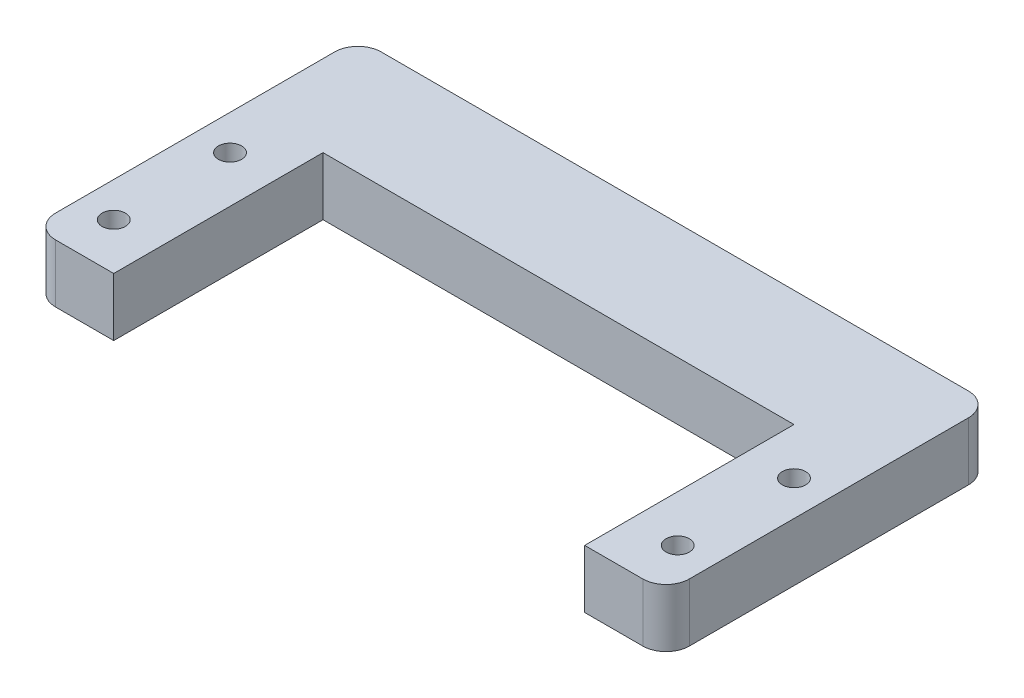
ISO-10303-21;
HEADER;
FILE_DESCRIPTION(('STEP AP214'),'2;1');
FILE_NAME('part.step','',(''),(''),'','','');
FILE_SCHEMA(('AUTOMOTIVE_DESIGN { 1 0 10303 214 1 1 1 1 }'));
ENDSEC;
DATA;
#1=APPLICATION_CONTEXT('core data for automotive mechanical design processes');
#2=APPLICATION_PROTOCOL_DEFINITION('international standard','automotive_design',2000,#1);
#3=PRODUCT_CONTEXT('',#1,'mechanical');
#4=PRODUCT('Part','Part','',(#3));
#5=PRODUCT_RELATED_PRODUCT_CATEGORY('part','',(#4));
#6=PRODUCT_DEFINITION_FORMATION('','',#4);
#7=PRODUCT_DEFINITION_CONTEXT('part definition',#1,'design');
#8=PRODUCT_DEFINITION('design','',#6,#7);
#9=PRODUCT_DEFINITION_SHAPE('','',#8);
#10=(LENGTH_UNIT() NAMED_UNIT(*) SI_UNIT(.MILLI.,.METRE.));
#11=(NAMED_UNIT(*) PLANE_ANGLE_UNIT() SI_UNIT($,.RADIAN.));
#12=(NAMED_UNIT(*) SI_UNIT($,.STERADIAN.) SOLID_ANGLE_UNIT());
#13=UNCERTAINTY_MEASURE_WITH_UNIT(LENGTH_MEASURE(1.E-05),#10,'distance_accuracy_value','');
#14=(GEOMETRIC_REPRESENTATION_CONTEXT(3) GLOBAL_UNCERTAINTY_ASSIGNED_CONTEXT((#13)) GLOBAL_UNIT_ASSIGNED_CONTEXT((#10,
#11,#12)) REPRESENTATION_CONTEXT('',''));
#15=CARTESIAN_POINT('',(0.,0.,0.));
#16=DIRECTION('',(0.,0.,1.));
#17=DIRECTION('',(1.,0.,0.));
#18=AXIS2_PLACEMENT_3D('',#15,#16,#17);
#19=CARTESIAN_POINT('',(-25.25,5.,7.00000000000001));
#20=DIRECTION('',(0.,-1.,0.));
#21=DIRECTION('',(0.,0.,-1.));
#22=AXIS2_PLACEMENT_3D('',#19,#20,#21);
#23=CYLINDRICAL_SURFACE('',#22,2.);
#24=CARTESIAN_POINT('',(-25.25,0.,7.00000000000001));
#25=DIRECTION('',(0.,1.,0.));
#26=DIRECTION('',(0.,0.,1.));
#27=AXIS2_PLACEMENT_3D('',#24,#25,#26);
#28=CIRCLE('',#27,2.);
#29=CARTESIAN_POINT('',(-25.25,0.,9.00000000000001));
#30=VERTEX_POINT('',#29);
#31=CARTESIAN_POINT('',(-27.25,0.,6.99999999999999));
#32=VERTEX_POINT('',#31);
#33=EDGE_CURVE('E132',#30,#32,#28,.F.);
#34=ORIENTED_EDGE('',*,*,#33,.F.);
#35=DIRECTION('',(0.,-1.,0.));
#36=VECTOR('',#35,1.);
#37=CARTESIAN_POINT('',(-25.25,5.,9.00000000000001));
#38=LINE('',#37,#36);
#39=CARTESIAN_POINT('',(-25.25,5.,9.00000000000001));
#40=VERTEX_POINT('',#39);
#41=EDGE_CURVE('E128',#40,#30,#38,.T.);
#42=ORIENTED_EDGE('',*,*,#41,.F.);
#43=CARTESIAN_POINT('',(-25.25,5.,7.00000000000001));
#44=DIRECTION('',(0.,1.,0.));
#45=DIRECTION('',(0.,0.,1.));
#46=AXIS2_PLACEMENT_3D('',#43,#44,#45);
#47=CIRCLE('',#46,2.);
#48=CARTESIAN_POINT('',(-27.25,5.,6.99999999999999));
#49=VERTEX_POINT('',#48);
#50=EDGE_CURVE('E130',#40,#49,#47,.F.);
#51=ORIENTED_EDGE('',*,*,#50,.T.);
#52=DIRECTION('',(0.,-1.,0.));
#53=VECTOR('',#52,1.);
#54=CARTESIAN_POINT('',(-27.25,5.,6.99999999999999));
#55=LINE('',#54,#53);
#56=EDGE_CURVE('E181',#49,#32,#55,.T.);
#57=ORIENTED_EDGE('',*,*,#56,.T.);
#58=EDGE_LOOP('',(#34,#42,#51,#57));
#59=FACE_BOUND('',#58,.T.);
#60=ADVANCED_FACE('F35',(#59),#23,.T.);
#61=CARTESIAN_POINT('',(0.,5.,9.00000000000001));
#62=DIRECTION('',(0.,0.,1.));
#63=DIRECTION('',(1.,0.,0.));
#64=AXIS2_PLACEMENT_3D('',#61,#62,#63);
#65=PLANE('',#64);
#66=DIRECTION('',(-1.,0.,0.));
#67=VECTOR('',#66,1.);
#68=CARTESIAN_POINT('',(0.,0.,9.00000000000001));
#69=LINE('',#68,#67);
#70=CARTESIAN_POINT('',(-20.25,0.,9.00000000000001));
#71=VERTEX_POINT('',#70);
#72=EDGE_CURVE('E183',#71,#30,#69,.T.);
#73=ORIENTED_EDGE('',*,*,#72,.F.);
#74=DIRECTION('',(0.,-1.,0.));
#75=VECTOR('',#74,1.);
#76=CARTESIAN_POINT('',(-20.25,5.,9.00000000000001));
#77=LINE('',#76,#75);
#78=CARTESIAN_POINT('',(-20.25,5.,9.00000000000001));
#79=VERTEX_POINT('',#78);
#80=EDGE_CURVE('E138',#79,#71,#77,.T.);
#81=ORIENTED_EDGE('',*,*,#80,.F.);
#82=DIRECTION('',(-1.,0.,0.));
#83=VECTOR('',#82,1.);
#84=CARTESIAN_POINT('',(0.,5.,9.00000000000001));
#85=LINE('',#84,#83);
#86=EDGE_CURVE('E143',#79,#40,#85,.T.);
#87=ORIENTED_EDGE('',*,*,#86,.T.);
#88=ORIENTED_EDGE('',*,*,#41,.T.);
#89=EDGE_LOOP('',(#73,#81,#87,#88));
#90=FACE_BOUND('',#89,.T.);
#91=ADVANCED_FACE('F147',(#90),#65,.T.);
#92=CARTESIAN_POINT('',(-20.25,5.,0.));
#93=DIRECTION('',(-1.,0.,0.));
#94=DIRECTION('',(0.,0.,1.));
#95=AXIS2_PLACEMENT_3D('',#92,#93,#94);
#96=PLANE('',#95);
#97=DIRECTION('',(0.,0.,-1.));
#98=VECTOR('',#97,1.);
#99=CARTESIAN_POINT('',(-20.25,0.,0.));
#100=LINE('',#99,#98);
#101=CARTESIAN_POINT('',(-20.25,0.,-8.99999999999999));
#102=VERTEX_POINT('',#101);
#103=EDGE_CURVE('E185',#71,#102,#100,.T.);
#104=ORIENTED_EDGE('',*,*,#103,.T.);
#105=DIRECTION('',(0.,-1.,0.));
#106=VECTOR('',#105,1.);
#107=CARTESIAN_POINT('',(-20.25,5.,-8.99999999999999));
#108=LINE('',#107,#106);
#109=CARTESIAN_POINT('',(-20.25,5.,-8.99999999999999));
#110=VERTEX_POINT('',#109);
#111=EDGE_CURVE('E228',#110,#102,#108,.T.);
#112=ORIENTED_EDGE('',*,*,#111,.F.);
#113=DIRECTION('',(0.,0.,-1.));
#114=VECTOR('',#113,1.);
#115=CARTESIAN_POINT('',(-20.25,5.,0.));
#116=LINE('',#115,#114);
#117=EDGE_CURVE('E149',#79,#110,#116,.T.);
#118=ORIENTED_EDGE('',*,*,#117,.F.);
#119=ORIENTED_EDGE('',*,*,#80,.T.);
#120=EDGE_LOOP('',(#104,#112,#118,#119));
#121=FACE_BOUND('',#120,.T.);
#122=ADVANCED_FACE('F273',(#121),#96,.F.);
#123=CARTESIAN_POINT('',(0.,5.,-8.99999999999999));
#124=DIRECTION('',(0.,0.,1.));
#125=DIRECTION('',(1.,0.,0.));
#126=AXIS2_PLACEMENT_3D('',#123,#124,#125);
#127=PLANE('',#126);
#128=DIRECTION('',(-1.,0.,0.));
#129=VECTOR('',#128,1.);
#130=CARTESIAN_POINT('',(0.,0.,-8.99999999999999));
#131=LINE('',#130,#129);
#132=CARTESIAN_POINT('',(20.25,0.,-8.99999999999999));
#133=VERTEX_POINT('',#132);
#134=EDGE_CURVE('E188',#133,#102,#131,.T.);
#135=ORIENTED_EDGE('',*,*,#134,.F.);
#136=DIRECTION('',(0.,-1.,0.));
#137=VECTOR('',#136,1.);
#138=CARTESIAN_POINT('',(20.25,5.,-8.99999999999999));
#139=LINE('',#138,#137);
#140=CARTESIAN_POINT('',(20.25,5.,-8.99999999999999));
#141=VERTEX_POINT('',#140);
#142=EDGE_CURVE('E226',#141,#133,#139,.T.);
#143=ORIENTED_EDGE('',*,*,#142,.F.);
#144=DIRECTION('',(-1.,0.,0.));
#145=VECTOR('',#144,1.);
#146=CARTESIAN_POINT('',(0.,5.,-8.99999999999999));
#147=LINE('',#146,#145);
#148=EDGE_CURVE('E151',#141,#110,#147,.T.);
#149=ORIENTED_EDGE('',*,*,#148,.T.);
#150=ORIENTED_EDGE('',*,*,#111,.T.);
#151=EDGE_LOOP('',(#135,#143,#149,#150));
#152=FACE_BOUND('',#151,.T.);
#153=ADVANCED_FACE('F269',(#152),#127,.T.);
#154=CARTESIAN_POINT('',(20.25,5.,0.));
#155=DIRECTION('',(-1.,0.,0.));
#156=DIRECTION('',(0.,0.,1.));
#157=AXIS2_PLACEMENT_3D('',#154,#155,#156);
#158=PLANE('',#157);
#159=DIRECTION('',(0.,0.,-1.));
#160=VECTOR('',#159,1.);
#161=CARTESIAN_POINT('',(20.25,0.,0.));
#162=LINE('',#161,#160);
#163=CARTESIAN_POINT('',(20.25,0.,9.00000000000001));
#164=VERTEX_POINT('',#163);
#165=EDGE_CURVE('E191',#164,#133,#162,.T.);
#166=ORIENTED_EDGE('',*,*,#165,.F.);
#167=DIRECTION('',(0.,-1.,0.));
#168=VECTOR('',#167,1.);
#169=CARTESIAN_POINT('',(20.25,5.,9.00000000000001));
#170=LINE('',#169,#168);
#171=CARTESIAN_POINT('',(20.25,5.,9.00000000000001));
#172=VERTEX_POINT('',#171);
#173=EDGE_CURVE('E224',#172,#164,#170,.T.);
#174=ORIENTED_EDGE('',*,*,#173,.F.);
#175=DIRECTION('',(0.,0.,-1.));
#176=VECTOR('',#175,1.);
#177=CARTESIAN_POINT('',(20.25,5.,0.));
#178=LINE('',#177,#176);
#179=EDGE_CURVE('E156',#172,#141,#178,.T.);
#180=ORIENTED_EDGE('',*,*,#179,.T.);
#181=ORIENTED_EDGE('',*,*,#142,.T.);
#182=EDGE_LOOP('',(#166,#174,#180,#181));
#183=FACE_BOUND('',#182,.T.);
#184=ADVANCED_FACE('F263',(#183),#158,.T.);
#185=CARTESIAN_POINT('',(0.,5.,9.00000000000001));
#186=DIRECTION('',(0.,0.,-1.));
#187=DIRECTION('',(-1.,0.,0.));
#188=AXIS2_PLACEMENT_3D('',#185,#186,#187);
#189=PLANE('',#188);
#190=DIRECTION('',(1.,0.,0.));
#191=VECTOR('',#190,1.);
#192=CARTESIAN_POINT('',(0.,0.,9.00000000000001));
#193=LINE('',#192,#191);
#194=CARTESIAN_POINT('',(25.25,0.,9.00000000000001));
#195=VERTEX_POINT('',#194);
#196=EDGE_CURVE('E194',#164,#195,#193,.T.);
#197=ORIENTED_EDGE('',*,*,#196,.T.);
#198=DIRECTION('',(0.,-1.,0.));
#199=VECTOR('',#198,1.);
#200=CARTESIAN_POINT('',(25.25,5.,9.00000000000001));
#201=LINE('',#200,#199);
#202=CARTESIAN_POINT('',(25.25,5.,9.00000000000001));
#203=VERTEX_POINT('',#202);
#204=EDGE_CURVE('E222',#203,#195,#201,.T.);
#205=ORIENTED_EDGE('',*,*,#204,.F.);
#206=DIRECTION('',(1.,0.,0.));
#207=VECTOR('',#206,1.);
#208=CARTESIAN_POINT('',(0.,5.,9.00000000000001));
#209=LINE('',#208,#207);
#210=EDGE_CURVE('E159',#172,#203,#209,.T.);
#211=ORIENTED_EDGE('',*,*,#210,.F.);
#212=ORIENTED_EDGE('',*,*,#173,.T.);
#213=EDGE_LOOP('',(#197,#205,#211,#212));
#214=FACE_BOUND('',#213,.T.);
#215=ADVANCED_FACE('F274',(#214),#189,.F.);
#216=CARTESIAN_POINT('',(25.25,5.,7.00000000000001));
#217=DIRECTION('',(0.,-1.,0.));
#218=DIRECTION('',(0.,0.,-1.));
#219=AXIS2_PLACEMENT_3D('',#216,#217,#218);
#220=CYLINDRICAL_SURFACE('',#219,2.);
#221=CARTESIAN_POINT('',(25.25,0.,7.00000000000001));
#222=DIRECTION('',(0.,1.,0.));
#223=DIRECTION('',(0.,0.,1.));
#224=AXIS2_PLACEMENT_3D('',#221,#222,#223);
#225=CIRCLE('',#224,2.);
#226=CARTESIAN_POINT('',(27.25,0.,7.));
#227=VERTEX_POINT('',#226);
#228=EDGE_CURVE('E197',#227,#195,#225,.F.);
#229=ORIENTED_EDGE('',*,*,#228,.F.);
#230=DIRECTION('',(0.,-1.,0.));
#231=VECTOR('',#230,1.);
#232=CARTESIAN_POINT('',(27.25,5.,7.));
#233=LINE('',#232,#231);
#234=CARTESIAN_POINT('',(27.25,5.,7.));
#235=VERTEX_POINT('',#234);
#236=EDGE_CURVE('E220',#235,#227,#233,.T.);
#237=ORIENTED_EDGE('',*,*,#236,.F.);
#238=CARTESIAN_POINT('',(25.25,5.,7.00000000000001));
#239=DIRECTION('',(0.,1.,0.));
#240=DIRECTION('',(0.,0.,1.));
#241=AXIS2_PLACEMENT_3D('',#238,#239,#240);
#242=CIRCLE('',#241,2.);
#243=EDGE_CURVE('E161',#235,#203,#242,.F.);
#244=ORIENTED_EDGE('',*,*,#243,.T.);
#245=ORIENTED_EDGE('',*,*,#204,.T.);
#246=EDGE_LOOP('',(#229,#237,#244,#245));
#247=FACE_BOUND('',#246,.T.);
#248=ADVANCED_FACE('F257',(#247),#220,.T.);
#249=CARTESIAN_POINT('',(27.25,5.,0.));
#250=DIRECTION('',(-1.,0.,0.));
#251=DIRECTION('',(0.,0.,1.));
#252=AXIS2_PLACEMENT_3D('',#249,#250,#251);
#253=PLANE('',#252);
#254=DIRECTION('',(0.,0.,-1.));
#255=VECTOR('',#254,1.);
#256=CARTESIAN_POINT('',(27.25,0.,0.));
#257=LINE('',#256,#255);
#258=CARTESIAN_POINT('',(27.25,0.,-17.));
#259=VERTEX_POINT('',#258);
#260=EDGE_CURVE('E200',#227,#259,#257,.T.);
#261=ORIENTED_EDGE('',*,*,#260,.T.);
#262=DIRECTION('',(0.,-1.,0.));
#263=VECTOR('',#262,1.);
#264=CARTESIAN_POINT('',(27.25,5.,-17.));
#265=LINE('',#264,#263);
#266=CARTESIAN_POINT('',(27.25,5.,-17.));
#267=VERTEX_POINT('',#266);
#268=EDGE_CURVE('E58',#259,#267,#265,.F.);
#269=ORIENTED_EDGE('',*,*,#268,.T.);
#270=DIRECTION('',(0.,0.,-1.));
#271=VECTOR('',#270,1.);
#272=CARTESIAN_POINT('',(27.25,5.,0.));
#273=LINE('',#272,#271);
#274=EDGE_CURVE('E164',#235,#267,#273,.T.);
#275=ORIENTED_EDGE('',*,*,#274,.F.);
#276=ORIENTED_EDGE('',*,*,#236,.T.);
#277=EDGE_LOOP('',(#261,#269,#275,#276));
#278=FACE_BOUND('',#277,.T.);
#279=ADVANCED_FACE('F255',(#278),#253,.F.);
#280=CARTESIAN_POINT('',(0.,5.,-19.));
#281=DIRECTION('',(0.,0.,1.));
#282=DIRECTION('',(1.,0.,0.));
#283=AXIS2_PLACEMENT_3D('',#280,#281,#282);
#284=PLANE('',#283);
#285=DIRECTION('',(-1.,0.,0.));
#286=VECTOR('',#285,1.);
#287=CARTESIAN_POINT('',(0.,5.,-19.));
#288=LINE('',#287,#286);
#289=CARTESIAN_POINT('',(25.25,5.,-19.));
#290=VERTEX_POINT('',#289);
#291=CARTESIAN_POINT('',(-25.25,5.,-19.));
#292=VERTEX_POINT('',#291);
#293=EDGE_CURVE('E166',#290,#292,#288,.T.);
#294=ORIENTED_EDGE('',*,*,#293,.F.);
#295=DIRECTION('',(0.,-1.,0.));
#296=VECTOR('',#295,1.);
#297=CARTESIAN_POINT('',(25.25,5.,-19.));
#298=LINE('',#297,#296);
#299=CARTESIAN_POINT('',(25.25,0.,-19.));
#300=VERTEX_POINT('',#299);
#301=EDGE_CURVE('E232',#290,#300,#298,.T.);
#302=ORIENTED_EDGE('',*,*,#301,.T.);
#303=DIRECTION('',(-1.,0.,0.));
#304=VECTOR('',#303,1.);
#305=CARTESIAN_POINT('',(0.,0.,-19.));
#306=LINE('',#305,#304);
#307=CARTESIAN_POINT('',(-25.25,0.,-19.));
#308=VERTEX_POINT('',#307);
#309=EDGE_CURVE('E202',#300,#308,#306,.T.);
#310=ORIENTED_EDGE('',*,*,#309,.T.);
#311=DIRECTION('',(0.,-1.,0.));
#312=VECTOR('',#311,1.);
#313=CARTESIAN_POINT('',(-25.25,5.,-19.));
#314=LINE('',#313,#312);
#315=EDGE_CURVE('E137',#308,#292,#314,.F.);
#316=ORIENTED_EDGE('',*,*,#315,.T.);
#317=EDGE_LOOP('',(#294,#302,#310,#316));
#318=FACE_BOUND('',#317,.T.);
#319=ADVANCED_FACE('F246',(#318),#284,.F.);
#320=CARTESIAN_POINT('',(24.25,5.,-4.99999999999999));
#321=DIRECTION('',(0.,-1.,0.));
#322=DIRECTION('',(0.,0.,-1.));
#323=AXIS2_PLACEMENT_3D('',#320,#321,#322);
#324=CYLINDRICAL_SURFACE('',#323,0.999999999999998);
#325=CARTESIAN_POINT('',(24.25,5.,-4.99999999999999));
#326=DIRECTION('',(0.,1.,0.));
#327=DIRECTION('',(0.,0.,1.));
#328=AXIS2_PLACEMENT_3D('',#325,#326,#327);
#329=CIRCLE('',#328,0.999999999999998);
#330=CARTESIAN_POINT('',(24.25,5.,-3.99999999999999));
#331=VERTEX_POINT('',#330);
#332=EDGE_CURVE('E175',#331,#331,#329,.T.);
#333=ORIENTED_EDGE('',*,*,#332,.T.);
#334=EDGE_LOOP('',(#333));
#335=FACE_BOUND('',#334,.T.);
#336=CARTESIAN_POINT('',(24.25,0.,-4.99999999999999));
#337=DIRECTION('',(0.,1.,0.));
#338=DIRECTION('',(0.,0.,1.));
#339=AXIS2_PLACEMENT_3D('',#336,#337,#338);
#340=CIRCLE('',#339,0.999999999999998);
#341=CARTESIAN_POINT('',(24.25,0.,-3.99999999999999));
#342=VERTEX_POINT('',#341);
#343=EDGE_CURVE('E214',#342,#342,#340,.T.);
#344=ORIENTED_EDGE('',*,*,#343,.F.);
#345=EDGE_LOOP('',(#344));
#346=FACE_BOUND('',#345,.T.);
#347=ADVANCED_FACE('F307',(#335,#346),#324,.F.);
#348=CARTESIAN_POINT('',(-24.25,5.,-4.99999999999999));
#349=DIRECTION('',(0.,-1.,0.));
#350=DIRECTION('',(0.,0.,-1.));
#351=AXIS2_PLACEMENT_3D('',#348,#349,#350);
#352=CYLINDRICAL_SURFACE('',#351,0.999999999999998);
#353=CARTESIAN_POINT('',(-24.25,5.,-4.99999999999999));
#354=DIRECTION('',(0.,1.,0.));
#355=DIRECTION('',(0.,0.,1.));
#356=AXIS2_PLACEMENT_3D('',#353,#354,#355);
#357=CIRCLE('',#356,0.999999999999998);
#358=CARTESIAN_POINT('',(-24.25,5.,-3.99999999999999));
#359=VERTEX_POINT('',#358);
#360=EDGE_CURVE('E172',#359,#359,#357,.T.);
#361=ORIENTED_EDGE('',*,*,#360,.T.);
#362=EDGE_LOOP('',(#361));
#363=FACE_BOUND('',#362,.T.);
#364=CARTESIAN_POINT('',(-24.25,0.,-4.99999999999999));
#365=DIRECTION('',(0.,1.,0.));
#366=DIRECTION('',(0.,0.,1.));
#367=AXIS2_PLACEMENT_3D('',#364,#365,#366);
#368=CIRCLE('',#367,0.999999999999998);
#369=CARTESIAN_POINT('',(-24.25,0.,-3.99999999999999));
#370=VERTEX_POINT('',#369);
#371=EDGE_CURVE('E211',#370,#370,#368,.T.);
#372=ORIENTED_EDGE('',*,*,#371,.F.);
#373=EDGE_LOOP('',(#372));
#374=FACE_BOUND('',#373,.T.);
#375=ADVANCED_FACE('F310',(#363,#374),#352,.F.);
#376=CARTESIAN_POINT('',(-24.25,5.,5.00000000000001));
#377=DIRECTION('',(0.,-1.,0.));
#378=DIRECTION('',(0.,0.,-1.));
#379=AXIS2_PLACEMENT_3D('',#376,#377,#378);
#380=CYLINDRICAL_SURFACE('',#379,0.999999999999997);
#381=CARTESIAN_POINT('',(-24.25,5.,5.00000000000001));
#382=DIRECTION('',(0.,1.,0.));
#383=DIRECTION('',(0.,0.,1.));
#384=AXIS2_PLACEMENT_3D('',#381,#382,#383);
#385=CIRCLE('',#384,0.999999999999997);
#386=CARTESIAN_POINT('',(-24.25,5.,6.00000000000001));
#387=VERTEX_POINT('',#386);
#388=EDGE_CURVE('E169',#387,#387,#385,.T.);
#389=ORIENTED_EDGE('',*,*,#388,.T.);
#390=EDGE_LOOP('',(#389));
#391=FACE_BOUND('',#390,.T.);
#392=CARTESIAN_POINT('',(-24.25,0.,5.00000000000001));
#393=DIRECTION('',(0.,1.,0.));
#394=DIRECTION('',(0.,0.,1.));
#395=AXIS2_PLACEMENT_3D('',#392,#393,#394);
#396=CIRCLE('',#395,0.999999999999997);
#397=CARTESIAN_POINT('',(-24.25,0.,6.00000000000001));
#398=VERTEX_POINT('',#397);
#399=EDGE_CURVE('E208',#398,#398,#396,.T.);
#400=ORIENTED_EDGE('',*,*,#399,.F.);
#401=EDGE_LOOP('',(#400));
#402=FACE_BOUND('',#401,.T.);
#403=ADVANCED_FACE('F314',(#391,#402),#380,.F.);
#404=CARTESIAN_POINT('',(-27.25,5.,0.));
#405=DIRECTION('',(-1.,0.,0.));
#406=DIRECTION('',(0.,0.,1.));
#407=AXIS2_PLACEMENT_3D('',#404,#405,#406);
#408=PLANE('',#407);
#409=DIRECTION('',(0.,0.,-1.));
#410=VECTOR('',#409,1.);
#411=CARTESIAN_POINT('',(-27.25,5.,0.));
#412=LINE('',#411,#410);
#413=CARTESIAN_POINT('',(-27.25,5.,-17.));
#414=VERTEX_POINT('',#413);
#415=EDGE_CURVE('E144',#49,#414,#412,.T.);
#416=ORIENTED_EDGE('',*,*,#415,.T.);
#417=DIRECTION('',(0.,-1.,0.));
#418=VECTOR('',#417,1.);
#419=CARTESIAN_POINT('',(-27.25,0.,-17.));
#420=LINE('',#419,#418);
#421=CARTESIAN_POINT('',(-27.25,0.,-17.));
#422=VERTEX_POINT('',#421);
#423=EDGE_CURVE('E11',#414,#422,#420,.T.);
#424=ORIENTED_EDGE('',*,*,#423,.T.);
#425=DIRECTION('',(0.,0.,-1.));
#426=VECTOR('',#425,1.);
#427=CARTESIAN_POINT('',(-27.25,0.,0.));
#428=LINE('',#427,#426);
#429=EDGE_CURVE('E205',#32,#422,#428,.T.);
#430=ORIENTED_EDGE('',*,*,#429,.F.);
#431=ORIENTED_EDGE('',*,*,#56,.F.);
#432=EDGE_LOOP('',(#416,#424,#430,#431));
#433=FACE_BOUND('',#432,.T.);
#434=ADVANCED_FACE('F305',(#433),#408,.T.);
#435=CARTESIAN_POINT('',(24.25,5.,5.));
#436=DIRECTION('',(0.,-1.,0.));
#437=DIRECTION('',(0.,0.,-1.));
#438=AXIS2_PLACEMENT_3D('',#435,#436,#437);
#439=CYLINDRICAL_SURFACE('',#438,0.999999999999998);
#440=CARTESIAN_POINT('',(24.25,5.,5.));
#441=DIRECTION('',(0.,1.,0.));
#442=DIRECTION('',(0.,0.,1.));
#443=AXIS2_PLACEMENT_3D('',#440,#441,#442);
#444=CIRCLE('',#443,0.999999999999998);
#445=CARTESIAN_POINT('',(24.25,5.,6.));
#446=VERTEX_POINT('',#445);
#447=EDGE_CURVE('E178',#446,#446,#444,.T.);
#448=ORIENTED_EDGE('',*,*,#447,.T.);
#449=EDGE_LOOP('',(#448));
#450=FACE_BOUND('',#449,.T.);
#451=CARTESIAN_POINT('',(24.25,0.,5.));
#452=DIRECTION('',(0.,1.,0.));
#453=DIRECTION('',(0.,0.,1.));
#454=AXIS2_PLACEMENT_3D('',#451,#452,#453);
#455=CIRCLE('',#454,0.999999999999998);
#456=CARTESIAN_POINT('',(24.25,0.,6.));
#457=VERTEX_POINT('',#456);
#458=EDGE_CURVE('E145',#457,#457,#455,.T.);
#459=ORIENTED_EDGE('',*,*,#458,.F.);
#460=EDGE_LOOP('',(#459));
#461=FACE_BOUND('',#460,.T.);
#462=ADVANCED_FACE('F300',(#450,#461),#439,.F.);
#463=CARTESIAN_POINT('',(0.,5.,0.));
#464=DIRECTION('',(0.,1.,0.));
#465=DIRECTION('',(0.,0.,1.));
#466=AXIS2_PLACEMENT_3D('',#463,#464,#465);
#467=PLANE('',#466);
#468=ORIENTED_EDGE('',*,*,#274,.T.);
#469=CARTESIAN_POINT('',(25.25,5.,-17.));
#470=DIRECTION('',(0.,1.,0.));
#471=DIRECTION('',(0.,0.,1.));
#472=AXIS2_PLACEMENT_3D('',#469,#470,#471);
#473=CIRCLE('',#472,2.);
#474=EDGE_CURVE('E43',#267,#290,#473,.T.);
#475=ORIENTED_EDGE('',*,*,#474,.T.);
#476=ORIENTED_EDGE('',*,*,#293,.T.);
#477=CARTESIAN_POINT('',(-25.25,5.,-17.));
#478=DIRECTION('',(0.,1.,0.));
#479=DIRECTION('',(0.,0.,1.));
#480=AXIS2_PLACEMENT_3D('',#477,#478,#479);
#481=CIRCLE('',#480,2.);
#482=EDGE_CURVE('E50',#292,#414,#481,.T.);
#483=ORIENTED_EDGE('',*,*,#482,.T.);
#484=ORIENTED_EDGE('',*,*,#415,.F.);
#485=ORIENTED_EDGE('',*,*,#50,.F.);
#486=ORIENTED_EDGE('',*,*,#86,.F.);
#487=ORIENTED_EDGE('',*,*,#117,.T.);
#488=ORIENTED_EDGE('',*,*,#148,.F.);
#489=ORIENTED_EDGE('',*,*,#179,.F.);
#490=ORIENTED_EDGE('',*,*,#210,.T.);
#491=ORIENTED_EDGE('',*,*,#243,.F.);
#492=EDGE_LOOP('',(#468,#475,#476,#483,#484,#485,#486,#487,#488,#489,#490,#491));
#493=FACE_BOUND('',#492,.T.);
#494=ORIENTED_EDGE('',*,*,#388,.F.);
#495=EDGE_LOOP('',(#494));
#496=FACE_BOUND('',#495,.T.);
#497=ORIENTED_EDGE('',*,*,#360,.F.);
#498=EDGE_LOOP('',(#497));
#499=FACE_BOUND('',#498,.T.);
#500=ORIENTED_EDGE('',*,*,#332,.F.);
#501=EDGE_LOOP('',(#500));
#502=FACE_BOUND('',#501,.T.);
#503=ORIENTED_EDGE('',*,*,#447,.F.);
#504=EDGE_LOOP('',(#503));
#505=FACE_BOUND('',#504,.T.);
#506=ADVANCED_FACE('F141',(#493,#496,#499,#502,#505),#467,.T.);
#507=CARTESIAN_POINT('',(0.,0.,0.));
#508=DIRECTION('',(0.,1.,0.));
#509=DIRECTION('',(0.,0.,1.));
#510=AXIS2_PLACEMENT_3D('',#507,#508,#509);
#511=PLANE('',#510);
#512=ORIENTED_EDGE('',*,*,#309,.F.);
#513=CARTESIAN_POINT('',(25.25,0.,-17.));
#514=DIRECTION('',(0.,1.,0.));
#515=DIRECTION('',(0.,0.,1.));
#516=AXIS2_PLACEMENT_3D('',#513,#514,#515);
#517=CIRCLE('',#516,2.);
#518=EDGE_CURVE('E237',#300,#259,#517,.F.);
#519=ORIENTED_EDGE('',*,*,#518,.T.);
#520=ORIENTED_EDGE('',*,*,#260,.F.);
#521=ORIENTED_EDGE('',*,*,#228,.T.);
#522=ORIENTED_EDGE('',*,*,#196,.F.);
#523=ORIENTED_EDGE('',*,*,#165,.T.);
#524=ORIENTED_EDGE('',*,*,#134,.T.);
#525=ORIENTED_EDGE('',*,*,#103,.F.);
#526=ORIENTED_EDGE('',*,*,#72,.T.);
#527=ORIENTED_EDGE('',*,*,#33,.T.);
#528=ORIENTED_EDGE('',*,*,#429,.T.);
#529=CARTESIAN_POINT('',(-25.25,0.,-17.));
#530=DIRECTION('',(0.,1.,0.));
#531=DIRECTION('',(0.,0.,1.));
#532=AXIS2_PLACEMENT_3D('',#529,#530,#531);
#533=CIRCLE('',#532,2.);
#534=EDGE_CURVE('E235',#422,#308,#533,.F.);
#535=ORIENTED_EDGE('',*,*,#534,.T.);
#536=EDGE_LOOP('',(#512,#519,#520,#521,#522,#523,#524,#525,#526,#527,#528,#535));
#537=FACE_BOUND('',#536,.T.);
#538=ORIENTED_EDGE('',*,*,#399,.T.);
#539=EDGE_LOOP('',(#538));
#540=FACE_BOUND('',#539,.T.);
#541=ORIENTED_EDGE('',*,*,#371,.T.);
#542=EDGE_LOOP('',(#541));
#543=FACE_BOUND('',#542,.T.);
#544=ORIENTED_EDGE('',*,*,#343,.T.);
#545=EDGE_LOOP('',(#544));
#546=FACE_BOUND('',#545,.T.);
#547=ORIENTED_EDGE('',*,*,#458,.T.);
#548=EDGE_LOOP('',(#547));
#549=FACE_BOUND('',#548,.T.);
#550=ADVANCED_FACE('F252',(#537,#540,#543,#546,#549),#511,.F.);
#551=CARTESIAN_POINT('',(25.25,5.,-17.));
#552=DIRECTION('',(0.,-1.,0.));
#553=DIRECTION('',(0.,0.,-1.));
#554=AXIS2_PLACEMENT_3D('',#551,#552,#553);
#555=CYLINDRICAL_SURFACE('',#554,2.);
#556=ORIENTED_EDGE('',*,*,#474,.F.);
#557=ORIENTED_EDGE('',*,*,#268,.F.);
#558=ORIENTED_EDGE('',*,*,#518,.F.);
#559=ORIENTED_EDGE('',*,*,#301,.F.);
#560=EDGE_LOOP('',(#556,#557,#558,#559));
#561=FACE_BOUND('',#560,.T.);
#562=ADVANCED_FACE('F249',(#561),#555,.T.);
#563=CARTESIAN_POINT('',(-25.25,5.,-17.));
#564=DIRECTION('',(0.,1.,0.));
#565=DIRECTION('',(0.,0.,1.));
#566=AXIS2_PLACEMENT_3D('',#563,#564,#565);
#567=CYLINDRICAL_SURFACE('',#566,2.);
#568=ORIENTED_EDGE('',*,*,#482,.F.);
#569=ORIENTED_EDGE('',*,*,#315,.F.);
#570=ORIENTED_EDGE('',*,*,#534,.F.);
#571=ORIENTED_EDGE('',*,*,#423,.F.);
#572=EDGE_LOOP('',(#568,#569,#570,#571));
#573=FACE_BOUND('',#572,.T.);
#574=ADVANCED_FACE('F37',(#573),#567,.T.);
#575=CLOSED_SHELL('',(#60,#91,#122,#153,#184,#215,#248,#279,#319,#347,#375,#403,#434,#462,#506,
#550,#562,#574));
#576=MANIFOLD_SOLID_BREP('B2',#575);
#577=ADVANCED_BREP_SHAPE_REPRESENTATION('',(#18,#576),#14);
#578=SHAPE_DEFINITION_REPRESENTATION(#9,#577);
ENDSEC;
END-ISO-10303-21;
